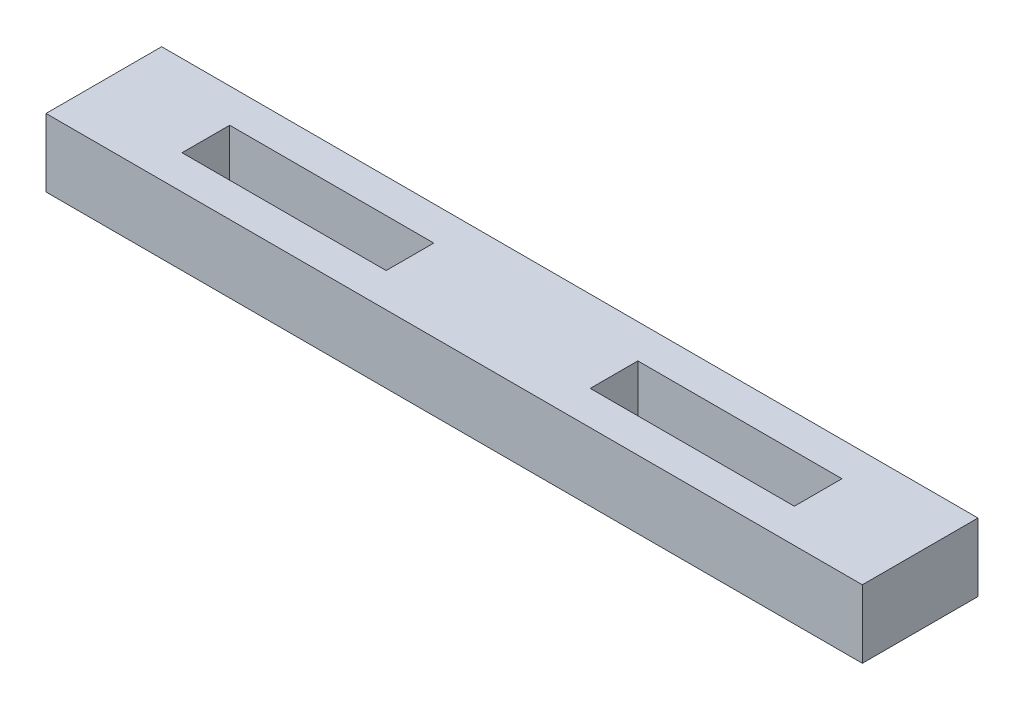
ISO-10303-21;
HEADER;
FILE_DESCRIPTION(('STEP AP214'),'2;1');
FILE_NAME('part.step','',(''),(''),'','','');
FILE_SCHEMA(('AUTOMOTIVE_DESIGN { 1 0 10303 214 1 1 1 1 }'));
ENDSEC;
DATA;
#1=APPLICATION_CONTEXT('core data for automotive mechanical design processes');
#2=APPLICATION_PROTOCOL_DEFINITION('international standard','automotive_design',2000,#1);
#3=PRODUCT_CONTEXT('',#1,'mechanical');
#4=PRODUCT('Part','Part','',(#3));
#5=PRODUCT_RELATED_PRODUCT_CATEGORY('part','',(#4));
#6=PRODUCT_DEFINITION_FORMATION('','',#4);
#7=PRODUCT_DEFINITION_CONTEXT('part definition',#1,'design');
#8=PRODUCT_DEFINITION('design','',#6,#7);
#9=PRODUCT_DEFINITION_SHAPE('','',#8);
#10=(LENGTH_UNIT() NAMED_UNIT(*) SI_UNIT(.MILLI.,.METRE.));
#11=(NAMED_UNIT(*) PLANE_ANGLE_UNIT() SI_UNIT($,.RADIAN.));
#12=(NAMED_UNIT(*) SI_UNIT($,.STERADIAN.) SOLID_ANGLE_UNIT());
#13=UNCERTAINTY_MEASURE_WITH_UNIT(LENGTH_MEASURE(1.E-05),#10,'distance_accuracy_value','');
#14=(GEOMETRIC_REPRESENTATION_CONTEXT(3) GLOBAL_UNCERTAINTY_ASSIGNED_CONTEXT((#13)) GLOBAL_UNIT_ASSIGNED_CONTEXT((#10,
#11,#12)) REPRESENTATION_CONTEXT('',''));
#15=CARTESIAN_POINT('',(0.,0.,0.));
#16=DIRECTION('',(0.,0.,1.));
#17=DIRECTION('',(1.,0.,0.));
#18=AXIS2_PLACEMENT_3D('',#15,#16,#17);
#19=CARTESIAN_POINT('',(0.,12.7,0.));
#20=DIRECTION('',(1.,0.,0.));
#21=DIRECTION('',(0.,0.,-1.));
#22=AXIS2_PLACEMENT_3D('',#19,#20,#21);
#23=PLANE('',#22);
#24=DIRECTION('',(0.,0.,1.));
#25=VECTOR('',#24,1.);
#26=CARTESIAN_POINT('',(0.,0.,0.));
#27=LINE('',#26,#25);
#28=CARTESIAN_POINT('',(0.,0.,-21.5899999999998));
#29=VERTEX_POINT('',#28);
#30=CARTESIAN_POINT('',(0.,0.,0.));
#31=VERTEX_POINT('',#30);
#32=EDGE_CURVE('E230',#29,#31,#27,.T.);
#33=ORIENTED_EDGE('',*,*,#32,.T.);
#34=DIRECTION('',(0.,-1.,0.));
#35=VECTOR('',#34,1.);
#36=CARTESIAN_POINT('',(0.,12.7,0.));
#37=LINE('',#36,#35);
#38=CARTESIAN_POINT('',(0.,12.7,0.));
#39=VERTEX_POINT('',#38);
#40=EDGE_CURVE('E11',#39,#31,#37,.T.);
#41=ORIENTED_EDGE('',*,*,#40,.F.);
#42=DIRECTION('',(0.,0.,1.));
#43=VECTOR('',#42,1.);
#44=CARTESIAN_POINT('',(0.,12.7,0.));
#45=LINE('',#44,#43);
#46=CARTESIAN_POINT('',(0.,12.7,-21.5899999999998));
#47=VERTEX_POINT('',#46);
#48=EDGE_CURVE('E231',#47,#39,#45,.T.);
#49=ORIENTED_EDGE('',*,*,#48,.F.);
#50=DIRECTION('',(0.,-1.,0.));
#51=VECTOR('',#50,1.);
#52=CARTESIAN_POINT('',(0.,12.7,-21.5899999999998));
#53=LINE('',#52,#51);
#54=EDGE_CURVE('E245',#47,#29,#53,.T.);
#55=ORIENTED_EDGE('',*,*,#54,.T.);
#56=EDGE_LOOP('',(#33,#41,#49,#55));
#57=FACE_BOUND('',#56,.T.);
#58=ADVANCED_FACE('F42',(#57),#23,.F.);
#59=CARTESIAN_POINT('',(0.,12.7,0.));
#60=DIRECTION('',(0.,0.,-1.));
#61=DIRECTION('',(-1.,0.,0.));
#62=AXIS2_PLACEMENT_3D('',#59,#60,#61);
#63=PLANE('',#62);
#64=DIRECTION('',(1.,0.,0.));
#65=VECTOR('',#64,1.);
#66=CARTESIAN_POINT('',(0.,0.,0.));
#67=LINE('',#66,#65);
#68=CARTESIAN_POINT('',(152.4,0.,0.));
#69=VERTEX_POINT('',#68);
#70=EDGE_CURVE('E249',#31,#69,#67,.T.);
#71=ORIENTED_EDGE('',*,*,#70,.T.);
#72=DIRECTION('',(0.,-1.,0.));
#73=VECTOR('',#72,1.);
#74=CARTESIAN_POINT('',(152.4,12.7,0.));
#75=LINE('',#74,#73);
#76=CARTESIAN_POINT('',(152.4,12.7,0.));
#77=VERTEX_POINT('',#76);
#78=EDGE_CURVE('E50',#77,#69,#75,.T.);
#79=ORIENTED_EDGE('',*,*,#78,.F.);
#80=DIRECTION('',(1.,0.,0.));
#81=VECTOR('',#80,1.);
#82=CARTESIAN_POINT('',(0.,12.7,0.));
#83=LINE('',#82,#81);
#84=EDGE_CURVE('E235',#39,#77,#83,.T.);
#85=ORIENTED_EDGE('',*,*,#84,.F.);
#86=ORIENTED_EDGE('',*,*,#40,.T.);
#87=EDGE_LOOP('',(#71,#79,#85,#86));
#88=FACE_BOUND('',#87,.T.);
#89=ADVANCED_FACE('F284',(#88),#63,.F.);
#90=CARTESIAN_POINT('',(152.4,12.7,0.));
#91=DIRECTION('',(-1.,0.,0.));
#92=DIRECTION('',(0.,0.,1.));
#93=AXIS2_PLACEMENT_3D('',#90,#91,#92);
#94=PLANE('',#93);
#95=DIRECTION('',(0.,0.,-1.));
#96=VECTOR('',#95,1.);
#97=CARTESIAN_POINT('',(152.4,0.,0.));
#98=LINE('',#97,#96);
#99=CARTESIAN_POINT('',(152.4,0.,-21.5899999999998));
#100=VERTEX_POINT('',#99);
#101=EDGE_CURVE('E252',#69,#100,#98,.T.);
#102=ORIENTED_EDGE('',*,*,#101,.T.);
#103=DIRECTION('',(0.,-1.,0.));
#104=VECTOR('',#103,1.);
#105=CARTESIAN_POINT('',(152.4,12.7,-21.5899999999998));
#106=LINE('',#105,#104);
#107=CARTESIAN_POINT('',(152.4,12.7,-21.5899999999998));
#108=VERTEX_POINT('',#107);
#109=EDGE_CURVE('E260',#108,#100,#106,.T.);
#110=ORIENTED_EDGE('',*,*,#109,.F.);
#111=DIRECTION('',(0.,0.,-1.));
#112=VECTOR('',#111,1.);
#113=CARTESIAN_POINT('',(152.4,12.7,0.));
#114=LINE('',#113,#112);
#115=EDGE_CURVE('E239',#77,#108,#114,.T.);
#116=ORIENTED_EDGE('',*,*,#115,.F.);
#117=ORIENTED_EDGE('',*,*,#78,.T.);
#118=EDGE_LOOP('',(#102,#110,#116,#117));
#119=FACE_BOUND('',#118,.T.);
#120=ADVANCED_FACE('F269',(#119),#94,.F.);
#121=CARTESIAN_POINT('',(0.,12.7,-21.5899999999998));
#122=DIRECTION('',(0.,0.,1.));
#123=DIRECTION('',(1.,0.,0.));
#124=AXIS2_PLACEMENT_3D('',#121,#122,#123);
#125=PLANE('',#124);
#126=DIRECTION('',(-1.,0.,0.));
#127=VECTOR('',#126,1.);
#128=CARTESIAN_POINT('',(0.,0.,-21.5899999999998));
#129=LINE('',#128,#127);
#130=EDGE_CURVE('E236',#100,#29,#129,.T.);
#131=ORIENTED_EDGE('',*,*,#130,.T.);
#132=ORIENTED_EDGE('',*,*,#54,.F.);
#133=DIRECTION('',(-1.,0.,0.));
#134=VECTOR('',#133,1.);
#135=CARTESIAN_POINT('',(0.,12.7,-21.5899999999998));
#136=LINE('',#135,#134);
#137=EDGE_CURVE('E242',#108,#47,#136,.T.);
#138=ORIENTED_EDGE('',*,*,#137,.F.);
#139=ORIENTED_EDGE('',*,*,#109,.T.);
#140=EDGE_LOOP('',(#131,#132,#138,#139));
#141=FACE_BOUND('',#140,.T.);
#142=ADVANCED_FACE('F277',(#141),#125,.F.);
#143=CARTESIAN_POINT('',(0.,12.7,0.));
#144=DIRECTION('',(0.,-1.,0.));
#145=DIRECTION('',(0.,0.,-1.));
#146=AXIS2_PLACEMENT_3D('',#143,#144,#145);
#147=PLANE('',#146);
#148=DIRECTION('',(-1.,0.,0.));
#149=VECTOR('',#148,1.);
#150=CARTESIAN_POINT('',(0.,12.7,-6.35));
#151=LINE('',#150,#149);
#152=CARTESIAN_POINT('',(57.15,12.7,-6.35));
#153=VERTEX_POINT('',#152);
#154=CARTESIAN_POINT('',(19.05,12.7,-6.35));
#155=VERTEX_POINT('',#154);
#156=EDGE_CURVE('E217',#153,#155,#151,.T.);
#157=ORIENTED_EDGE('',*,*,#156,.T.);
#158=DIRECTION('',(0.,0.,-1.));
#159=VECTOR('',#158,1.);
#160=CARTESIAN_POINT('',(19.05,12.7,0.));
#161=LINE('',#160,#159);
#162=CARTESIAN_POINT('',(19.05,12.7,-15.24));
#163=VERTEX_POINT('',#162);
#164=EDGE_CURVE('E136',#155,#163,#161,.T.);
#165=ORIENTED_EDGE('',*,*,#164,.T.);
#166=DIRECTION('',(1.,0.,0.));
#167=VECTOR('',#166,1.);
#168=CARTESIAN_POINT('',(0.,12.7,-15.24));
#169=LINE('',#168,#167);
#170=CARTESIAN_POINT('',(57.15,12.7,-15.24));
#171=VERTEX_POINT('',#170);
#172=EDGE_CURVE('E224',#163,#171,#169,.T.);
#173=ORIENTED_EDGE('',*,*,#172,.T.);
#174=DIRECTION('',(0.,0.,1.));
#175=VECTOR('',#174,1.);
#176=CARTESIAN_POINT('',(57.15,12.7,0.));
#177=LINE('',#176,#175);
#178=EDGE_CURVE('E220',#171,#153,#177,.T.);
#179=ORIENTED_EDGE('',*,*,#178,.T.);
#180=EDGE_LOOP('',(#157,#165,#173,#179));
#181=FACE_BOUND('',#180,.T.);
#182=DIRECTION('',(-1.,0.,0.));
#183=VECTOR('',#182,1.);
#184=CARTESIAN_POINT('',(0.,12.7,-6.35));
#185=LINE('',#184,#183);
#186=CARTESIAN_POINT('',(133.35,12.7,-6.35));
#187=VERTEX_POINT('',#186);
#188=CARTESIAN_POINT('',(95.25,12.7,-6.35));
#189=VERTEX_POINT('',#188);
#190=EDGE_CURVE('E170',#187,#189,#185,.T.);
#191=ORIENTED_EDGE('',*,*,#190,.T.);
#192=DIRECTION('',(0.,0.,-1.));
#193=VECTOR('',#192,1.);
#194=CARTESIAN_POINT('',(95.25,12.7,0.));
#195=LINE('',#194,#193);
#196=CARTESIAN_POINT('',(95.25,12.7,-15.24));
#197=VERTEX_POINT('',#196);
#198=EDGE_CURVE('E213',#189,#197,#195,.T.);
#199=ORIENTED_EDGE('',*,*,#198,.T.);
#200=DIRECTION('',(1.,0.,0.));
#201=VECTOR('',#200,1.);
#202=CARTESIAN_POINT('',(0.,12.7,-15.24));
#203=LINE('',#202,#201);
#204=CARTESIAN_POINT('',(133.35,12.7,-15.24));
#205=VERTEX_POINT('',#204);
#206=EDGE_CURVE('E209',#197,#205,#203,.T.);
#207=ORIENTED_EDGE('',*,*,#206,.T.);
#208=DIRECTION('',(0.,0.,1.));
#209=VECTOR('',#208,1.);
#210=CARTESIAN_POINT('',(133.35,12.7,0.));
#211=LINE('',#210,#209);
#212=EDGE_CURVE('E205',#205,#187,#211,.T.);
#213=ORIENTED_EDGE('',*,*,#212,.T.);
#214=EDGE_LOOP('',(#191,#199,#207,#213));
#215=FACE_BOUND('',#214,.T.);
#216=ORIENTED_EDGE('',*,*,#48,.T.);
#217=ORIENTED_EDGE('',*,*,#84,.T.);
#218=ORIENTED_EDGE('',*,*,#115,.T.);
#219=ORIENTED_EDGE('',*,*,#137,.T.);
#220=EDGE_LOOP('',(#216,#217,#218,#219));
#221=FACE_BOUND('',#220,.T.);
#222=ADVANCED_FACE('F283',(#181,#215,#221),#147,.F.);
#223=CARTESIAN_POINT('',(0.,0.,0.));
#224=DIRECTION('',(0.,-1.,0.));
#225=DIRECTION('',(0.,0.,-1.));
#226=AXIS2_PLACEMENT_3D('',#223,#224,#225);
#227=PLANE('',#226);
#228=DIRECTION('',(0.,0.,1.));
#229=VECTOR('',#228,1.);
#230=CARTESIAN_POINT('',(19.05,0.,-6.35));
#231=LINE('',#230,#229);
#232=CARTESIAN_POINT('',(19.05,0.,-15.24));
#233=VERTEX_POINT('',#232);
#234=CARTESIAN_POINT('',(19.05,0.,-6.35));
#235=VERTEX_POINT('',#234);
#236=EDGE_CURVE('E133',#233,#235,#231,.T.);
#237=ORIENTED_EDGE('',*,*,#236,.T.);
#238=DIRECTION('',(1.,0.,0.));
#239=VECTOR('',#238,1.);
#240=CARTESIAN_POINT('',(19.05,0.,-6.35));
#241=LINE('',#240,#239);
#242=CARTESIAN_POINT('',(57.15,0.,-6.35));
#243=VERTEX_POINT('',#242);
#244=EDGE_CURVE('E144',#235,#243,#241,.T.);
#245=ORIENTED_EDGE('',*,*,#244,.T.);
#246=DIRECTION('',(0.,0.,-1.));
#247=VECTOR('',#246,1.);
#248=CARTESIAN_POINT('',(57.15,0.,-6.35));
#249=LINE('',#248,#247);
#250=CARTESIAN_POINT('',(57.15,0.,-15.24));
#251=VERTEX_POINT('',#250);
#252=EDGE_CURVE('E150',#243,#251,#249,.T.);
#253=ORIENTED_EDGE('',*,*,#252,.T.);
#254=DIRECTION('',(-1.,0.,0.));
#255=VECTOR('',#254,1.);
#256=CARTESIAN_POINT('',(19.05,0.,-15.24));
#257=LINE('',#256,#255);
#258=EDGE_CURVE('E140',#251,#233,#257,.T.);
#259=ORIENTED_EDGE('',*,*,#258,.T.);
#260=EDGE_LOOP('',(#237,#245,#253,#259));
#261=FACE_BOUND('',#260,.T.);
#262=DIRECTION('',(0.,0.,1.));
#263=VECTOR('',#262,1.);
#264=CARTESIAN_POINT('',(95.25,0.,-15.24));
#265=LINE('',#264,#263);
#266=CARTESIAN_POINT('',(95.25,0.,-15.24));
#267=VERTEX_POINT('',#266);
#268=CARTESIAN_POINT('',(95.25,0.,-6.35));
#269=VERTEX_POINT('',#268);
#270=EDGE_CURVE('E156',#267,#269,#265,.T.);
#271=ORIENTED_EDGE('',*,*,#270,.T.);
#272=DIRECTION('',(1.,0.,0.));
#273=VECTOR('',#272,1.);
#274=CARTESIAN_POINT('',(95.25,0.,-6.35));
#275=LINE('',#274,#273);
#276=CARTESIAN_POINT('',(133.35,0.,-6.35));
#277=VERTEX_POINT('',#276);
#278=EDGE_CURVE('E160',#269,#277,#275,.T.);
#279=ORIENTED_EDGE('',*,*,#278,.T.);
#280=DIRECTION('',(0.,0.,-1.));
#281=VECTOR('',#280,1.);
#282=CARTESIAN_POINT('',(133.35,0.,-15.24));
#283=LINE('',#282,#281);
#284=CARTESIAN_POINT('',(133.35,0.,-15.24));
#285=VERTEX_POINT('',#284);
#286=EDGE_CURVE('E195',#277,#285,#283,.T.);
#287=ORIENTED_EDGE('',*,*,#286,.T.);
#288=DIRECTION('',(-1.,0.,0.));
#289=VECTOR('',#288,1.);
#290=CARTESIAN_POINT('',(95.25,0.,-15.24));
#291=LINE('',#290,#289);
#292=EDGE_CURVE('E179',#285,#267,#291,.T.);
#293=ORIENTED_EDGE('',*,*,#292,.T.);
#294=EDGE_LOOP('',(#271,#279,#287,#293));
#295=FACE_BOUND('',#294,.T.);
#296=ORIENTED_EDGE('',*,*,#32,.F.);
#297=ORIENTED_EDGE('',*,*,#130,.F.);
#298=ORIENTED_EDGE('',*,*,#101,.F.);
#299=ORIENTED_EDGE('',*,*,#70,.F.);
#300=EDGE_LOOP('',(#296,#297,#298,#299));
#301=FACE_BOUND('',#300,.T.);
#302=ADVANCED_FACE('F152',(#261,#295,#301),#227,.T.);
#303=CARTESIAN_POINT('',(95.25,0.,-15.24));
#304=DIRECTION('',(-1.,0.,0.));
#305=DIRECTION('',(0.,0.,1.));
#306=AXIS2_PLACEMENT_3D('',#303,#304,#305);
#307=PLANE('',#306);
#308=DIRECTION('',(0.,1.,0.));
#309=VECTOR('',#308,1.);
#310=CARTESIAN_POINT('',(95.25,0.,-6.35));
#311=LINE('',#310,#309);
#312=EDGE_CURVE('E65',#269,#189,#311,.T.);
#313=ORIENTED_EDGE('',*,*,#312,.F.);
#314=ORIENTED_EDGE('',*,*,#270,.F.);
#315=DIRECTION('',(0.,1.,0.));
#316=VECTOR('',#315,1.);
#317=CARTESIAN_POINT('',(95.25,0.,-15.24));
#318=LINE('',#317,#316);
#319=EDGE_CURVE('E188',#267,#197,#318,.T.);
#320=ORIENTED_EDGE('',*,*,#319,.T.);
#321=ORIENTED_EDGE('',*,*,#198,.F.);
#322=EDGE_LOOP('',(#313,#314,#320,#321));
#323=FACE_BOUND('',#322,.T.);
#324=ADVANCED_FACE('F296',(#323),#307,.F.);
#325=CARTESIAN_POINT('',(95.25,0.,-15.24));
#326=DIRECTION('',(0.,0.,-1.));
#327=DIRECTION('',(-1.,0.,0.));
#328=AXIS2_PLACEMENT_3D('',#325,#326,#327);
#329=PLANE('',#328);
#330=ORIENTED_EDGE('',*,*,#319,.F.);
#331=ORIENTED_EDGE('',*,*,#292,.F.);
#332=DIRECTION('',(0.,1.,0.));
#333=VECTOR('',#332,1.);
#334=CARTESIAN_POINT('',(133.35,0.,-15.24));
#335=LINE('',#334,#333);
#336=EDGE_CURVE('E184',#285,#205,#335,.T.);
#337=ORIENTED_EDGE('',*,*,#336,.T.);
#338=ORIENTED_EDGE('',*,*,#206,.F.);
#339=EDGE_LOOP('',(#330,#331,#337,#338));
#340=FACE_BOUND('',#339,.T.);
#341=ADVANCED_FACE('F300',(#340),#329,.F.);
#342=CARTESIAN_POINT('',(133.35,0.,-15.24));
#343=DIRECTION('',(1.,0.,0.));
#344=DIRECTION('',(0.,0.,-1.));
#345=AXIS2_PLACEMENT_3D('',#342,#343,#344);
#346=PLANE('',#345);
#347=ORIENTED_EDGE('',*,*,#336,.F.);
#348=ORIENTED_EDGE('',*,*,#286,.F.);
#349=DIRECTION('',(0.,1.,0.));
#350=VECTOR('',#349,1.);
#351=CARTESIAN_POINT('',(133.35,0.,-6.35));
#352=LINE('',#351,#350);
#353=EDGE_CURVE('E180',#277,#187,#352,.T.);
#354=ORIENTED_EDGE('',*,*,#353,.T.);
#355=ORIENTED_EDGE('',*,*,#212,.F.);
#356=EDGE_LOOP('',(#347,#348,#354,#355));
#357=FACE_BOUND('',#356,.T.);
#358=ADVANCED_FACE('F303',(#357),#346,.F.);
#359=CARTESIAN_POINT('',(95.25,0.,-6.35));
#360=DIRECTION('',(0.,0.,1.));
#361=DIRECTION('',(1.,0.,0.));
#362=AXIS2_PLACEMENT_3D('',#359,#360,#361);
#363=PLANE('',#362);
#364=ORIENTED_EDGE('',*,*,#353,.F.);
#365=ORIENTED_EDGE('',*,*,#278,.F.);
#366=ORIENTED_EDGE('',*,*,#312,.T.);
#367=ORIENTED_EDGE('',*,*,#190,.F.);
#368=EDGE_LOOP('',(#364,#365,#366,#367));
#369=FACE_BOUND('',#368,.T.);
#370=ADVANCED_FACE('F307',(#369),#363,.F.);
#371=CARTESIAN_POINT('',(19.05,0.,-6.35));
#372=DIRECTION('',(-1.,0.,0.));
#373=DIRECTION('',(0.,0.,1.));
#374=AXIS2_PLACEMENT_3D('',#371,#372,#373);
#375=PLANE('',#374);
#376=DIRECTION('',(0.,1.,0.));
#377=VECTOR('',#376,1.);
#378=CARTESIAN_POINT('',(19.05,0.,-6.35));
#379=LINE('',#378,#377);
#380=EDGE_CURVE('E57',#235,#155,#379,.T.);
#381=ORIENTED_EDGE('',*,*,#380,.F.);
#382=ORIENTED_EDGE('',*,*,#236,.F.);
#383=DIRECTION('',(0.,1.,0.));
#384=VECTOR('',#383,1.);
#385=CARTESIAN_POINT('',(19.05,0.,-15.24));
#386=LINE('',#385,#384);
#387=EDGE_CURVE('E167',#233,#163,#386,.T.);
#388=ORIENTED_EDGE('',*,*,#387,.T.);
#389=ORIENTED_EDGE('',*,*,#164,.F.);
#390=EDGE_LOOP('',(#381,#382,#388,#389));
#391=FACE_BOUND('',#390,.T.);
#392=ADVANCED_FACE('F130',(#391),#375,.F.);
#393=CARTESIAN_POINT('',(19.05,0.,-15.24));
#394=DIRECTION('',(0.,0.,-1.));
#395=DIRECTION('',(-1.,0.,0.));
#396=AXIS2_PLACEMENT_3D('',#393,#394,#395);
#397=PLANE('',#396);
#398=ORIENTED_EDGE('',*,*,#387,.F.);
#399=ORIENTED_EDGE('',*,*,#258,.F.);
#400=DIRECTION('',(0.,1.,0.));
#401=VECTOR('',#400,1.);
#402=CARTESIAN_POINT('',(57.15,0.,-15.24));
#403=LINE('',#402,#401);
#404=EDGE_CURVE('E171',#251,#171,#403,.T.);
#405=ORIENTED_EDGE('',*,*,#404,.T.);
#406=ORIENTED_EDGE('',*,*,#172,.F.);
#407=EDGE_LOOP('',(#398,#399,#405,#406));
#408=FACE_BOUND('',#407,.T.);
#409=ADVANCED_FACE('F316',(#408),#397,.F.);
#410=CARTESIAN_POINT('',(57.15,0.,-6.35));
#411=DIRECTION('',(1.,0.,0.));
#412=DIRECTION('',(0.,0.,-1.));
#413=AXIS2_PLACEMENT_3D('',#410,#411,#412);
#414=PLANE('',#413);
#415=ORIENTED_EDGE('',*,*,#404,.F.);
#416=ORIENTED_EDGE('',*,*,#252,.F.);
#417=DIRECTION('',(0.,1.,0.));
#418=VECTOR('',#417,1.);
#419=CARTESIAN_POINT('',(57.15,0.,-6.35));
#420=LINE('',#419,#418);
#421=EDGE_CURVE('E139',#243,#153,#420,.T.);
#422=ORIENTED_EDGE('',*,*,#421,.T.);
#423=ORIENTED_EDGE('',*,*,#178,.F.);
#424=EDGE_LOOP('',(#415,#416,#422,#423));
#425=FACE_BOUND('',#424,.T.);
#426=ADVANCED_FACE('F319',(#425),#414,.F.);
#427=CARTESIAN_POINT('',(19.05,0.,-6.35));
#428=DIRECTION('',(0.,0.,1.));
#429=DIRECTION('',(1.,0.,0.));
#430=AXIS2_PLACEMENT_3D('',#427,#428,#429);
#431=PLANE('',#430);
#432=ORIENTED_EDGE('',*,*,#421,.F.);
#433=ORIENTED_EDGE('',*,*,#244,.F.);
#434=ORIENTED_EDGE('',*,*,#380,.T.);
#435=ORIENTED_EDGE('',*,*,#156,.F.);
#436=EDGE_LOOP('',(#432,#433,#434,#435));
#437=FACE_BOUND('',#436,.T.);
#438=ADVANCED_FACE('F145',(#437),#431,.F.);
#439=CLOSED_SHELL('',(#58,#89,#120,#142,#222,#302,#324,#341,#358,#370,#392,#409,#426,#438));
#440=MANIFOLD_SOLID_BREP('B2',#439);
#441=ADVANCED_BREP_SHAPE_REPRESENTATION('',(#18,#440),#14);
#442=SHAPE_DEFINITION_REPRESENTATION(#9,#441);
ENDSEC;
END-ISO-10303-21;
